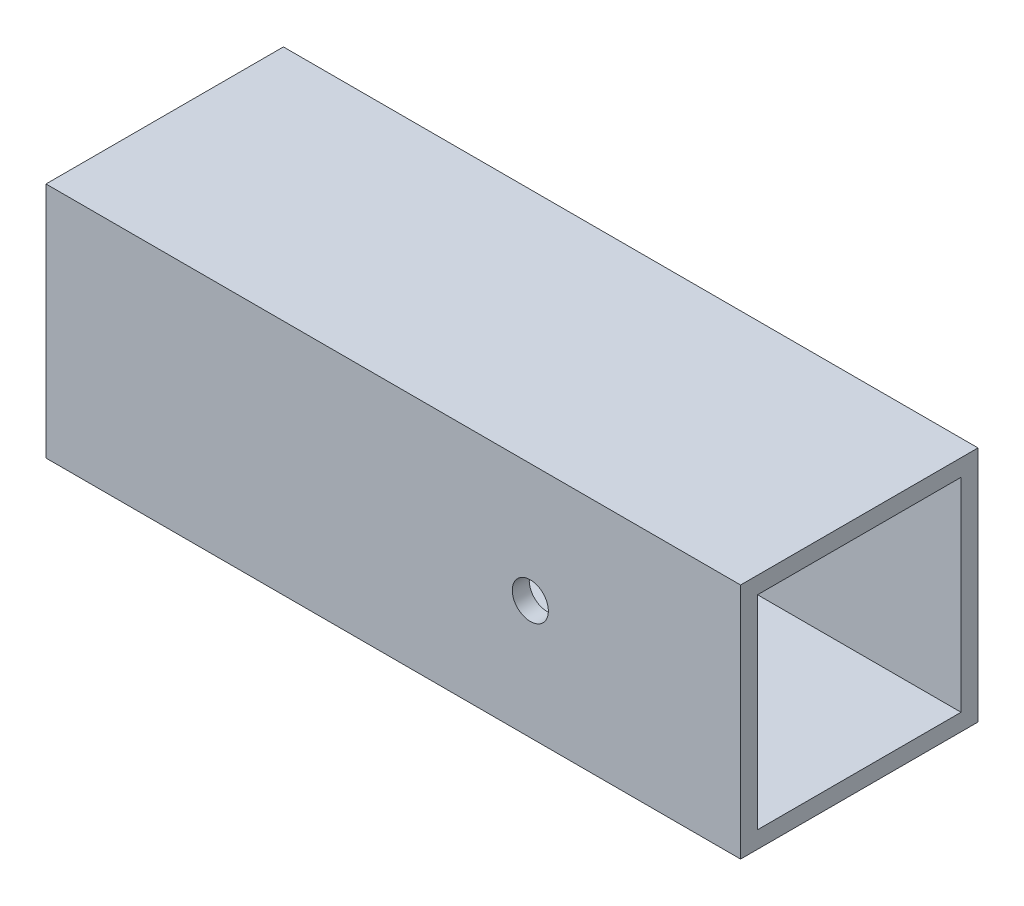
ISO-10303-21;
HEADER;
FILE_DESCRIPTION(('STEP AP214'),'2;1');
FILE_NAME('part.step','',(''),(''),'','','');
FILE_SCHEMA(('AUTOMOTIVE_DESIGN { 1 0 10303 214 1 1 1 1 }'));
ENDSEC;
DATA;
#1=APPLICATION_CONTEXT('core data for automotive mechanical design processes');
#2=APPLICATION_PROTOCOL_DEFINITION('international standard','automotive_design',2000,#1);
#3=PRODUCT_CONTEXT('',#1,'mechanical');
#4=PRODUCT('Part','Part','',(#3));
#5=PRODUCT_RELATED_PRODUCT_CATEGORY('part','',(#4));
#6=PRODUCT_DEFINITION_FORMATION('','',#4);
#7=PRODUCT_DEFINITION_CONTEXT('part definition',#1,'design');
#8=PRODUCT_DEFINITION('design','',#6,#7);
#9=PRODUCT_DEFINITION_SHAPE('','',#8);
#10=(LENGTH_UNIT() NAMED_UNIT(*) SI_UNIT(.MILLI.,.METRE.));
#11=(NAMED_UNIT(*) PLANE_ANGLE_UNIT() SI_UNIT($,.RADIAN.));
#12=(NAMED_UNIT(*) SI_UNIT($,.STERADIAN.) SOLID_ANGLE_UNIT());
#13=UNCERTAINTY_MEASURE_WITH_UNIT(LENGTH_MEASURE(1.E-05),#10,'distance_accuracy_value','');
#14=(GEOMETRIC_REPRESENTATION_CONTEXT(3) GLOBAL_UNCERTAINTY_ASSIGNED_CONTEXT((#13)) GLOBAL_UNIT_ASSIGNED_CONTEXT((#10,
#11,#12)) REPRESENTATION_CONTEXT('',''));
#15=CARTESIAN_POINT('',(0.,0.,0.));
#16=DIRECTION('',(0.,0.,1.));
#17=DIRECTION('',(1.,0.,0.));
#18=AXIS2_PLACEMENT_3D('',#15,#16,#17);
#19=CARTESIAN_POINT('',(130.048,0.,0.));
#20=DIRECTION('',(-1.,0.,0.));
#21=DIRECTION('',(0.,0.,1.));
#22=AXIS2_PLACEMENT_3D('',#19,#20,#21);
#23=PLANE('',#22);
#24=DIRECTION('',(0.,-1.,0.));
#25=VECTOR('',#24,1.);
#26=CARTESIAN_POINT('',(130.048,0.,0.));
#27=LINE('',#26,#25);
#28=CARTESIAN_POINT('',(130.048,44.45,0.));
#29=VERTEX_POINT('',#28);
#30=CARTESIAN_POINT('',(130.048,0.,0.));
#31=VERTEX_POINT('',#30);
#32=EDGE_CURVE('E136',#29,#31,#27,.T.);
#33=ORIENTED_EDGE('',*,*,#32,.T.);
#34=DIRECTION('',(0.,0.,-1.));
#35=VECTOR('',#34,1.);
#36=CARTESIAN_POINT('',(130.048,0.,0.));
#37=LINE('',#36,#35);
#38=CARTESIAN_POINT('',(130.048,0.,-44.4499999999999));
#39=VERTEX_POINT('',#38);
#40=EDGE_CURVE('E139',#31,#39,#37,.T.);
#41=ORIENTED_EDGE('',*,*,#40,.T.);
#42=DIRECTION('',(0.,1.,0.));
#43=VECTOR('',#42,1.);
#44=CARTESIAN_POINT('',(130.048,0.,-44.4499999999999));
#45=LINE('',#44,#43);
#46=CARTESIAN_POINT('',(130.048,44.45,-44.4499999999999));
#47=VERTEX_POINT('',#46);
#48=EDGE_CURVE('E142',#39,#47,#45,.T.);
#49=ORIENTED_EDGE('',*,*,#48,.T.);
#50=DIRECTION('',(0.,0.,1.));
#51=VECTOR('',#50,1.);
#52=CARTESIAN_POINT('',(130.048,44.45,0.));
#53=LINE('',#52,#51);
#54=EDGE_CURVE('E144',#47,#29,#53,.T.);
#55=ORIENTED_EDGE('',*,*,#54,.T.);
#56=EDGE_LOOP('',(#33,#41,#49,#55));
#57=FACE_BOUND('',#56,.T.);
#58=DIRECTION('',(0.,0.,-1.));
#59=VECTOR('',#58,1.);
#60=CARTESIAN_POINT('',(130.048,3.17500000000004,-3.17499999999993));
#61=LINE('',#60,#59);
#62=CARTESIAN_POINT('',(130.048,3.17500000000004,-3.17499999999993));
#63=VERTEX_POINT('',#62);
#64=CARTESIAN_POINT('',(130.048,3.17500000000004,-41.275));
#65=VERTEX_POINT('',#64);
#66=EDGE_CURVE('E98',#63,#65,#61,.T.);
#67=ORIENTED_EDGE('',*,*,#66,.F.);
#68=DIRECTION('',(0.,-1.,0.));
#69=VECTOR('',#68,1.);
#70=CARTESIAN_POINT('',(130.048,3.17500000000004,-3.17499999999993));
#71=LINE('',#70,#69);
#72=CARTESIAN_POINT('',(130.048,41.2749999999999,-3.17499999999993));
#73=VERTEX_POINT('',#72);
#74=EDGE_CURVE('E120',#73,#63,#71,.T.);
#75=ORIENTED_EDGE('',*,*,#74,.F.);
#76=DIRECTION('',(0.,0.,1.));
#77=VECTOR('',#76,1.);
#78=CARTESIAN_POINT('',(130.048,41.2749999999999,-3.17499999999993));
#79=LINE('',#78,#77);
#80=CARTESIAN_POINT('',(130.048,41.2749999999999,-41.275));
#81=VERTEX_POINT('',#80);
#82=EDGE_CURVE('E118',#81,#73,#79,.T.);
#83=ORIENTED_EDGE('',*,*,#82,.F.);
#84=DIRECTION('',(0.,1.,0.));
#85=VECTOR('',#84,1.);
#86=CARTESIAN_POINT('',(130.048,3.17500000000004,-41.275));
#87=LINE('',#86,#85);
#88=EDGE_CURVE('E106',#65,#81,#87,.T.);
#89=ORIENTED_EDGE('',*,*,#88,.F.);
#90=EDGE_LOOP('',(#67,#75,#83,#89));
#91=FACE_BOUND('',#90,.T.);
#92=ADVANCED_FACE('F32',(#57,#91),#23,.F.);
#93=CARTESIAN_POINT('',(0.,0.,0.));
#94=DIRECTION('',(-1.,0.,0.));
#95=DIRECTION('',(0.,0.,1.));
#96=AXIS2_PLACEMENT_3D('',#93,#94,#95);
#97=PLANE('',#96);
#98=DIRECTION('',(0.,-1.,0.));
#99=VECTOR('',#98,1.);
#100=CARTESIAN_POINT('',(0.,0.,0.));
#101=LINE('',#100,#99);
#102=CARTESIAN_POINT('',(0.,44.45,0.));
#103=VERTEX_POINT('',#102);
#104=CARTESIAN_POINT('',(0.,0.,0.));
#105=VERTEX_POINT('',#104);
#106=EDGE_CURVE('E114',#103,#105,#101,.T.);
#107=ORIENTED_EDGE('',*,*,#106,.F.);
#108=DIRECTION('',(0.,0.,1.));
#109=VECTOR('',#108,1.);
#110=CARTESIAN_POINT('',(0.,44.45,0.));
#111=LINE('',#110,#109);
#112=CARTESIAN_POINT('',(0.,44.45,-44.4499999999999));
#113=VERTEX_POINT('',#112);
#114=EDGE_CURVE('E140',#113,#103,#111,.T.);
#115=ORIENTED_EDGE('',*,*,#114,.F.);
#116=DIRECTION('',(0.,1.,0.));
#117=VECTOR('',#116,1.);
#118=CARTESIAN_POINT('',(0.,0.,-44.4499999999999));
#119=LINE('',#118,#117);
#120=CARTESIAN_POINT('',(0.,0.,-44.4499999999999));
#121=VERTEX_POINT('',#120);
#122=EDGE_CURVE('E151',#121,#113,#119,.T.);
#123=ORIENTED_EDGE('',*,*,#122,.F.);
#124=DIRECTION('',(0.,0.,-1.));
#125=VECTOR('',#124,1.);
#126=CARTESIAN_POINT('',(0.,0.,0.));
#127=LINE('',#126,#125);
#128=EDGE_CURVE('E149',#105,#121,#127,.T.);
#129=ORIENTED_EDGE('',*,*,#128,.F.);
#130=EDGE_LOOP('',(#107,#115,#123,#129));
#131=FACE_BOUND('',#130,.T.);
#132=DIRECTION('',(0.,-1.,0.));
#133=VECTOR('',#132,1.);
#134=CARTESIAN_POINT('',(0.,3.17500000000004,-3.17500000000001));
#135=LINE('',#134,#133);
#136=CARTESIAN_POINT('',(0.,41.2749999999999,-3.17500000000001));
#137=VERTEX_POINT('',#136);
#138=CARTESIAN_POINT('',(0.,3.17500000000004,-3.17500000000001));
#139=VERTEX_POINT('',#138);
#140=EDGE_CURVE('E107',#137,#139,#135,.T.);
#141=ORIENTED_EDGE('',*,*,#140,.T.);
#142=DIRECTION('',(0.,0.,-1.));
#143=VECTOR('',#142,1.);
#144=CARTESIAN_POINT('',(0.,3.17500000000004,-3.17500000000001));
#145=LINE('',#144,#143);
#146=CARTESIAN_POINT('',(0.,3.17500000000004,-41.2749999999999));
#147=VERTEX_POINT('',#146);
#148=EDGE_CURVE('E56',#139,#147,#145,.T.);
#149=ORIENTED_EDGE('',*,*,#148,.T.);
#150=DIRECTION('',(0.,1.,0.));
#151=VECTOR('',#150,1.);
#152=CARTESIAN_POINT('',(0.,3.17500000000004,-41.2749999999999));
#153=LINE('',#152,#151);
#154=CARTESIAN_POINT('',(0.,41.2749999999999,-41.2749999999999));
#155=VERTEX_POINT('',#154);
#156=EDGE_CURVE('E113',#147,#155,#153,.T.);
#157=ORIENTED_EDGE('',*,*,#156,.T.);
#158=DIRECTION('',(0.,0.,1.));
#159=VECTOR('',#158,1.);
#160=CARTESIAN_POINT('',(0.,41.2749999999999,-3.17500000000001));
#161=LINE('',#160,#159);
#162=EDGE_CURVE('E128',#155,#137,#161,.T.);
#163=ORIENTED_EDGE('',*,*,#162,.T.);
#164=EDGE_LOOP('',(#141,#149,#157,#163));
#165=FACE_BOUND('',#164,.T.);
#166=ADVANCED_FACE('F170',(#131,#165),#97,.T.);
#167=CARTESIAN_POINT('',(130.048,0.,0.));
#168=DIRECTION('',(0.,0.,-1.));
#169=DIRECTION('',(-1.,0.,0.));
#170=AXIS2_PLACEMENT_3D('',#167,#168,#169);
#171=PLANE('',#170);
#172=CARTESIAN_POINT('',(90.678,22.2250000000001,0.));
#173=DIRECTION('',(0.,0.,1.));
#174=DIRECTION('',(1.,0.,0.));
#175=AXIS2_PLACEMENT_3D('',#172,#173,#174);
#176=CIRCLE('',#175,3.37819999999998);
#177=CARTESIAN_POINT('',(94.0562,22.2250000000001,0.));
#178=VERTEX_POINT('',#177);
#179=EDGE_CURVE('E231',#178,#178,#176,.T.);
#180=ORIENTED_EDGE('',*,*,#179,.F.);
#181=EDGE_LOOP('',(#180));
#182=FACE_BOUND('',#181,.T.);
#183=ORIENTED_EDGE('',*,*,#106,.T.);
#184=DIRECTION('',(-1.,0.,0.));
#185=VECTOR('',#184,1.);
#186=CARTESIAN_POINT('',(130.048,0.,0.));
#187=LINE('',#186,#185);
#188=EDGE_CURVE('E11',#31,#105,#187,.T.);
#189=ORIENTED_EDGE('',*,*,#188,.F.);
#190=ORIENTED_EDGE('',*,*,#32,.F.);
#191=DIRECTION('',(-1.,0.,0.));
#192=VECTOR('',#191,1.);
#193=CARTESIAN_POINT('',(130.048,44.45,0.));
#194=LINE('',#193,#192);
#195=EDGE_CURVE('E146',#29,#103,#194,.T.);
#196=ORIENTED_EDGE('',*,*,#195,.T.);
#197=EDGE_LOOP('',(#183,#189,#190,#196));
#198=FACE_BOUND('',#197,.T.);
#199=ADVANCED_FACE('F34',(#182,#198),#171,.F.);
#200=CARTESIAN_POINT('',(130.048,0.,0.));
#201=DIRECTION('',(0.,1.,0.));
#202=DIRECTION('',(0.,0.,1.));
#203=AXIS2_PLACEMENT_3D('',#200,#201,#202);
#204=PLANE('',#203);
#205=ORIENTED_EDGE('',*,*,#128,.T.);
#206=DIRECTION('',(-1.,0.,0.));
#207=VECTOR('',#206,1.);
#208=CARTESIAN_POINT('',(130.048,0.,-44.4499999999999));
#209=LINE('',#208,#207);
#210=EDGE_CURVE('E41',#39,#121,#209,.T.);
#211=ORIENTED_EDGE('',*,*,#210,.F.);
#212=ORIENTED_EDGE('',*,*,#40,.F.);
#213=ORIENTED_EDGE('',*,*,#188,.T.);
#214=EDGE_LOOP('',(#205,#211,#212,#213));
#215=FACE_BOUND('',#214,.T.);
#216=ADVANCED_FACE('F180',(#215),#204,.F.);
#217=CARTESIAN_POINT('',(130.048,0.,-44.4499999999999));
#218=DIRECTION('',(0.,0.,1.));
#219=DIRECTION('',(1.,0.,0.));
#220=AXIS2_PLACEMENT_3D('',#217,#218,#219);
#221=PLANE('',#220);
#222=CARTESIAN_POINT('',(90.678,22.2250000000001,-44.4499999999999));
#223=DIRECTION('',(0.,0.,1.));
#224=DIRECTION('',(1.,0.,0.));
#225=AXIS2_PLACEMENT_3D('',#222,#223,#224);
#226=CIRCLE('',#225,3.37819999999998);
#227=CARTESIAN_POINT('',(94.0562,22.2250000000001,-44.4499999999999));
#228=VERTEX_POINT('',#227);
#229=EDGE_CURVE('E230',#228,#228,#226,.T.);
#230=ORIENTED_EDGE('',*,*,#229,.T.);
#231=EDGE_LOOP('',(#230));
#232=FACE_BOUND('',#231,.T.);
#233=ORIENTED_EDGE('',*,*,#122,.T.);
#234=DIRECTION('',(-1.,0.,0.));
#235=VECTOR('',#234,1.);
#236=CARTESIAN_POINT('',(130.048,44.45,-44.4499999999999));
#237=LINE('',#236,#235);
#238=EDGE_CURVE('E156',#47,#113,#237,.T.);
#239=ORIENTED_EDGE('',*,*,#238,.F.);
#240=ORIENTED_EDGE('',*,*,#48,.F.);
#241=ORIENTED_EDGE('',*,*,#210,.T.);
#242=EDGE_LOOP('',(#233,#239,#240,#241));
#243=FACE_BOUND('',#242,.T.);
#244=ADVANCED_FACE('F164',(#232,#243),#221,.F.);
#245=CARTESIAN_POINT('',(130.048,44.45,0.));
#246=DIRECTION('',(0.,-1.,0.));
#247=DIRECTION('',(0.,0.,-1.));
#248=AXIS2_PLACEMENT_3D('',#245,#246,#247);
#249=PLANE('',#248);
#250=ORIENTED_EDGE('',*,*,#114,.T.);
#251=ORIENTED_EDGE('',*,*,#195,.F.);
#252=ORIENTED_EDGE('',*,*,#54,.F.);
#253=ORIENTED_EDGE('',*,*,#238,.T.);
#254=EDGE_LOOP('',(#250,#251,#252,#253));
#255=FACE_BOUND('',#254,.T.);
#256=ADVANCED_FACE('F174',(#255),#249,.F.);
#257=CARTESIAN_POINT('',(130.048,3.17500000000004,-3.17499999999993));
#258=DIRECTION('',(0.,1.,0.));
#259=DIRECTION('',(0.,0.,1.));
#260=AXIS2_PLACEMENT_3D('',#257,#258,#259);
#261=PLANE('',#260);
#262=ORIENTED_EDGE('',*,*,#148,.F.);
#263=DIRECTION('',(-1.,0.,0.));
#264=VECTOR('',#263,1.);
#265=CARTESIAN_POINT('',(130.048,3.17500000000004,-3.17499999999993));
#266=LINE('',#265,#264);
#267=EDGE_CURVE('E102',#63,#139,#266,.T.);
#268=ORIENTED_EDGE('',*,*,#267,.F.);
#269=ORIENTED_EDGE('',*,*,#66,.T.);
#270=DIRECTION('',(-1.,0.,0.));
#271=VECTOR('',#270,1.);
#272=CARTESIAN_POINT('',(130.048,3.17500000000004,-41.275));
#273=LINE('',#272,#271);
#274=EDGE_CURVE('E101',#65,#147,#273,.T.);
#275=ORIENTED_EDGE('',*,*,#274,.T.);
#276=EDGE_LOOP('',(#262,#268,#269,#275));
#277=FACE_BOUND('',#276,.T.);
#278=ADVANCED_FACE('F100',(#277),#261,.T.);
#279=CARTESIAN_POINT('',(130.048,3.17500000000004,-41.275));
#280=DIRECTION('',(0.,0.,1.));
#281=DIRECTION('',(0.,-1.,0.));
#282=AXIS2_PLACEMENT_3D('',#279,#280,#281);
#283=PLANE('',#282);
#284=CARTESIAN_POINT('',(90.6779999999999,22.2250000000001,-41.2749999999999));
#285=DIRECTION('',(0.,0.,1.));
#286=DIRECTION('',(0.,-1.,0.));
#287=AXIS2_PLACEMENT_3D('',#284,#285,#286);
#288=CIRCLE('',#287,3.37819999999998);
#289=CARTESIAN_POINT('',(90.6779999999999,18.8468000000001,-41.2749999999999));
#290=VERTEX_POINT('',#289);
#291=EDGE_CURVE('E36',#290,#290,#288,.T.);
#292=ORIENTED_EDGE('',*,*,#291,.F.);
#293=EDGE_LOOP('',(#292));
#294=FACE_BOUND('',#293,.T.);
#295=ORIENTED_EDGE('',*,*,#156,.F.);
#296=ORIENTED_EDGE('',*,*,#274,.F.);
#297=ORIENTED_EDGE('',*,*,#88,.T.);
#298=DIRECTION('',(-1.,0.,0.));
#299=VECTOR('',#298,1.);
#300=CARTESIAN_POINT('',(130.048,41.2749999999999,-41.275));
#301=LINE('',#300,#299);
#302=EDGE_CURVE('E115',#81,#155,#301,.T.);
#303=ORIENTED_EDGE('',*,*,#302,.T.);
#304=EDGE_LOOP('',(#295,#296,#297,#303));
#305=FACE_BOUND('',#304,.T.);
#306=ADVANCED_FACE('F110',(#294,#305),#283,.T.);
#307=CARTESIAN_POINT('',(130.048,41.2749999999999,-3.17499999999993));
#308=DIRECTION('',(0.,-1.,0.));
#309=DIRECTION('',(0.,0.,-1.));
#310=AXIS2_PLACEMENT_3D('',#307,#308,#309);
#311=PLANE('',#310);
#312=ORIENTED_EDGE('',*,*,#162,.F.);
#313=ORIENTED_EDGE('',*,*,#302,.F.);
#314=ORIENTED_EDGE('',*,*,#82,.T.);
#315=DIRECTION('',(-1.,0.,0.));
#316=VECTOR('',#315,1.);
#317=CARTESIAN_POINT('',(130.048,41.2749999999999,-3.17499999999993));
#318=LINE('',#317,#316);
#319=EDGE_CURVE('E48',#73,#137,#318,.T.);
#320=ORIENTED_EDGE('',*,*,#319,.T.);
#321=EDGE_LOOP('',(#312,#313,#314,#320));
#322=FACE_BOUND('',#321,.T.);
#323=ADVANCED_FACE('F205',(#322),#311,.T.);
#324=CARTESIAN_POINT('',(130.048,3.17500000000004,-3.17499999999993));
#325=DIRECTION('',(0.,0.,-1.));
#326=DIRECTION('',(0.,1.,0.));
#327=AXIS2_PLACEMENT_3D('',#324,#325,#326);
#328=PLANE('',#327);
#329=CARTESIAN_POINT('',(90.678,22.2250000000001,-3.17499999999987));
#330=DIRECTION('',(0.,0.,-1.));
#331=DIRECTION('',(0.,1.,0.));
#332=AXIS2_PLACEMENT_3D('',#329,#330,#331);
#333=CIRCLE('',#332,3.37819999999998);
#334=CARTESIAN_POINT('',(90.678,25.6032,-3.17499999999987));
#335=VERTEX_POINT('',#334);
#336=EDGE_CURVE('E126',#335,#335,#333,.T.);
#337=ORIENTED_EDGE('',*,*,#336,.F.);
#338=EDGE_LOOP('',(#337));
#339=FACE_BOUND('',#338,.T.);
#340=ORIENTED_EDGE('',*,*,#140,.F.);
#341=ORIENTED_EDGE('',*,*,#319,.F.);
#342=ORIENTED_EDGE('',*,*,#74,.T.);
#343=ORIENTED_EDGE('',*,*,#267,.T.);
#344=EDGE_LOOP('',(#340,#341,#342,#343));
#345=FACE_BOUND('',#344,.T.);
#346=ADVANCED_FACE('F210',(#339,#345),#328,.T.);
#347=CARTESIAN_POINT('',(90.678,22.2250000000001,0.));
#348=DIRECTION('',(0.,0.,1.));
#349=DIRECTION('',(1.,0.,0.));
#350=AXIS2_PLACEMENT_3D('',#347,#348,#349);
#351=CYLINDRICAL_SURFACE('',#350,3.37819999999998);
#352=ORIENTED_EDGE('',*,*,#291,.T.);
#353=EDGE_LOOP('',(#352));
#354=FACE_BOUND('',#353,.T.);
#355=ORIENTED_EDGE('',*,*,#229,.F.);
#356=EDGE_LOOP('',(#355));
#357=FACE_BOUND('',#356,.T.);
#358=ADVANCED_FACE('F217',(#354,#357),#351,.F.);
#359=ORIENTED_EDGE('',*,*,#336,.T.);
#360=EDGE_LOOP('',(#359));
#361=FACE_BOUND('',#360,.T.);
#362=ORIENTED_EDGE('',*,*,#179,.T.);
#363=EDGE_LOOP('',(#362));
#364=FACE_BOUND('',#363,.T.);
#365=ADVANCED_FACE('F220',(#361,#364),#351,.F.);
#366=CLOSED_SHELL('',(#92,#166,#199,#216,#244,#256,#278,#306,#323,#346,#358,#365));
#367=MANIFOLD_SOLID_BREP('B2',#366);
#368=ADVANCED_BREP_SHAPE_REPRESENTATION('',(#18,#367),#14);
#369=SHAPE_DEFINITION_REPRESENTATION(#9,#368);
ENDSEC;
END-ISO-10303-21;
